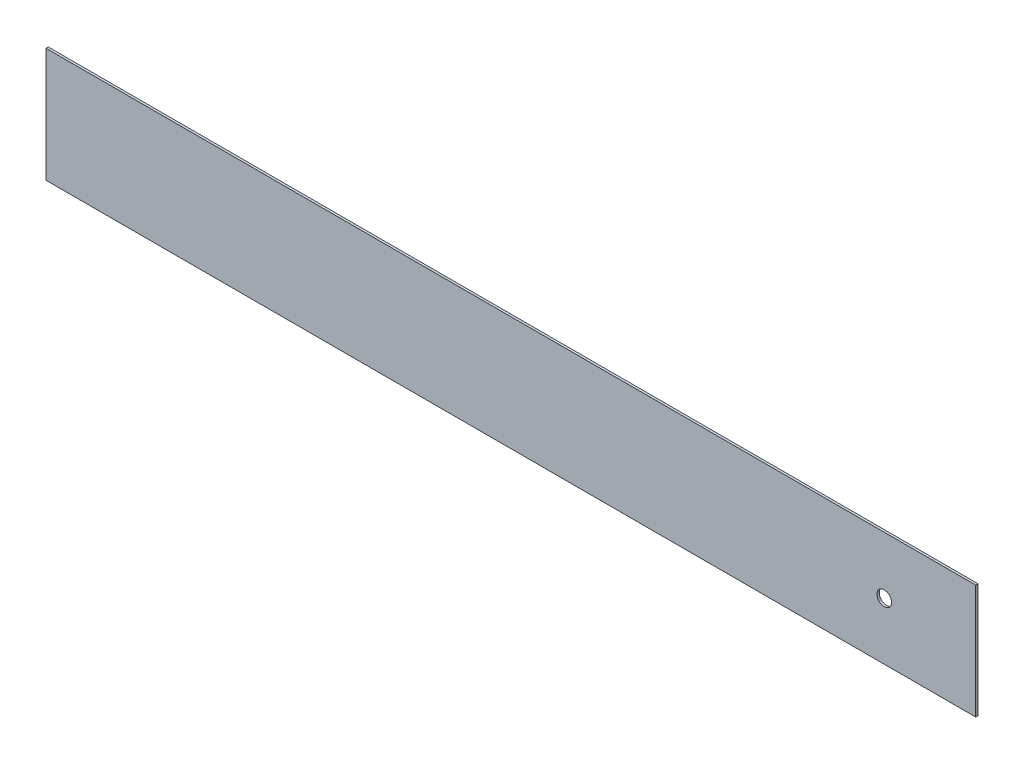
ISO-10303-21;
HEADER;
FILE_DESCRIPTION(('STEP AP214'),'2;1');
FILE_NAME('part.step','',(''),(''),'','','');
FILE_SCHEMA(('AUTOMOTIVE_DESIGN { 1 0 10303 214 1 1 1 1 }'));
ENDSEC;
DATA;
#1=APPLICATION_CONTEXT('core data for automotive mechanical design processes');
#2=APPLICATION_PROTOCOL_DEFINITION('international standard','automotive_design',2000,#1);
#3=PRODUCT_CONTEXT('',#1,'mechanical');
#4=PRODUCT('Part','Part','',(#3));
#5=PRODUCT_RELATED_PRODUCT_CATEGORY('part','',(#4));
#6=PRODUCT_DEFINITION_FORMATION('','',#4);
#7=PRODUCT_DEFINITION_CONTEXT('part definition',#1,'design');
#8=PRODUCT_DEFINITION('design','',#6,#7);
#9=PRODUCT_DEFINITION_SHAPE('','',#8);
#10=(LENGTH_UNIT() NAMED_UNIT(*) SI_UNIT(.MILLI.,.METRE.));
#11=(NAMED_UNIT(*) PLANE_ANGLE_UNIT() SI_UNIT($,.RADIAN.));
#12=(NAMED_UNIT(*) SI_UNIT($,.STERADIAN.) SOLID_ANGLE_UNIT());
#13=UNCERTAINTY_MEASURE_WITH_UNIT(LENGTH_MEASURE(1.E-05),#10,'distance_accuracy_value','');
#14=(GEOMETRIC_REPRESENTATION_CONTEXT(3) GLOBAL_UNCERTAINTY_ASSIGNED_CONTEXT((#13)) GLOBAL_UNIT_ASSIGNED_CONTEXT((#10,
#11,#12)) REPRESENTATION_CONTEXT('',''));
#15=CARTESIAN_POINT('',(0.,0.,0.));
#16=DIRECTION('',(0.,0.,1.));
#17=DIRECTION('',(1.,0.,0.));
#18=AXIS2_PLACEMENT_3D('',#15,#16,#17);
#19=CARTESIAN_POINT('',(0.,0.,3.));
#20=DIRECTION('',(0.,0.,1.));
#21=DIRECTION('',(1.,0.,0.));
#22=AXIS2_PLACEMENT_3D('',#19,#20,#21);
#23=PLANE('',#22);
#24=DIRECTION('',(0.,1.,0.));
#25=VECTOR('',#24,1.);
#26=CARTESIAN_POINT('',(610.,75.,3.));
#27=LINE('',#26,#25);
#28=CARTESIAN_POINT('',(610.,-75.,3.));
#29=VERTEX_POINT('',#28);
#30=CARTESIAN_POINT('',(610.,75.,3.));
#31=VERTEX_POINT('',#30);
#32=EDGE_CURVE('E87',#29,#31,#27,.T.);
#33=ORIENTED_EDGE('',*,*,#32,.T.);
#34=DIRECTION('',(-1.,0.,0.));
#35=VECTOR('',#34,1.);
#36=CARTESIAN_POINT('',(-610.,75.,3.));
#37=LINE('',#36,#35);
#38=CARTESIAN_POINT('',(-610.,75.,3.));
#39=VERTEX_POINT('',#38);
#40=EDGE_CURVE('E82',#31,#39,#37,.T.);
#41=ORIENTED_EDGE('',*,*,#40,.T.);
#42=DIRECTION('',(0.,-1.,0.));
#43=VECTOR('',#42,1.);
#44=CARTESIAN_POINT('',(-610.,75.,3.));
#45=LINE('',#44,#43);
#46=CARTESIAN_POINT('',(-610.,-75.,3.));
#47=VERTEX_POINT('',#46);
#48=EDGE_CURVE('E85',#39,#47,#45,.T.);
#49=ORIENTED_EDGE('',*,*,#48,.T.);
#50=DIRECTION('',(1.,0.,0.));
#51=VECTOR('',#50,1.);
#52=CARTESIAN_POINT('',(-610.,-75.,3.));
#53=LINE('',#52,#51);
#54=EDGE_CURVE('E52',#47,#29,#53,.T.);
#55=ORIENTED_EDGE('',*,*,#54,.T.);
#56=EDGE_LOOP('',(#33,#41,#49,#55));
#57=FACE_BOUND('',#56,.T.);
#58=CARTESIAN_POINT('',(490.,0.,3.));
#59=DIRECTION('',(0.,0.,1.));
#60=DIRECTION('',(1.,0.,0.));
#61=AXIS2_PLACEMENT_3D('',#58,#59,#60);
#62=CIRCLE('',#61,9.6);
#63=CARTESIAN_POINT('',(499.6,0.,3.));
#64=VERTEX_POINT('',#63);
#65=EDGE_CURVE('E102',#64,#64,#62,.T.);
#66=ORIENTED_EDGE('',*,*,#65,.F.);
#67=EDGE_LOOP('',(#66));
#68=FACE_BOUND('',#67,.T.);
#69=ADVANCED_FACE('F35',(#57,#68),#23,.T.);
#70=CARTESIAN_POINT('',(0.,0.,0.));
#71=DIRECTION('',(0.,0.,1.));
#72=DIRECTION('',(1.,0.,0.));
#73=AXIS2_PLACEMENT_3D('',#70,#71,#72);
#74=PLANE('',#73);
#75=DIRECTION('',(0.,1.,0.));
#76=VECTOR('',#75,1.);
#77=CARTESIAN_POINT('',(610.,75.,0.));
#78=LINE('',#77,#76);
#79=CARTESIAN_POINT('',(610.,-75.,0.));
#80=VERTEX_POINT('',#79);
#81=CARTESIAN_POINT('',(610.,75.,0.));
#82=VERTEX_POINT('',#81);
#83=EDGE_CURVE('E99',#80,#82,#78,.T.);
#84=ORIENTED_EDGE('',*,*,#83,.F.);
#85=DIRECTION('',(1.,0.,0.));
#86=VECTOR('',#85,1.);
#87=CARTESIAN_POINT('',(-610.,-75.,0.));
#88=LINE('',#87,#86);
#89=CARTESIAN_POINT('',(-610.,-75.,0.));
#90=VERTEX_POINT('',#89);
#91=EDGE_CURVE('E75',#90,#80,#88,.T.);
#92=ORIENTED_EDGE('',*,*,#91,.F.);
#93=DIRECTION('',(0.,-1.,0.));
#94=VECTOR('',#93,1.);
#95=CARTESIAN_POINT('',(-610.,75.,0.));
#96=LINE('',#95,#94);
#97=CARTESIAN_POINT('',(-610.,75.,0.));
#98=VERTEX_POINT('',#97);
#99=EDGE_CURVE('E69',#98,#90,#96,.T.);
#100=ORIENTED_EDGE('',*,*,#99,.F.);
#101=DIRECTION('',(-1.,0.,0.));
#102=VECTOR('',#101,1.);
#103=CARTESIAN_POINT('',(-610.,75.,0.));
#104=LINE('',#103,#102);
#105=EDGE_CURVE('E91',#82,#98,#104,.T.);
#106=ORIENTED_EDGE('',*,*,#105,.F.);
#107=EDGE_LOOP('',(#84,#92,#100,#106));
#108=FACE_BOUND('',#107,.T.);
#109=CARTESIAN_POINT('',(490.,0.,0.));
#110=DIRECTION('',(0.,0.,1.));
#111=DIRECTION('',(1.,0.,0.));
#112=AXIS2_PLACEMENT_3D('',#109,#110,#111);
#113=CIRCLE('',#112,9.6);
#114=CARTESIAN_POINT('',(499.6,0.,0.));
#115=VERTEX_POINT('',#114);
#116=EDGE_CURVE('E114',#115,#115,#113,.T.);
#117=ORIENTED_EDGE('',*,*,#116,.T.);
#118=EDGE_LOOP('',(#117));
#119=FACE_BOUND('',#118,.T.);
#120=ADVANCED_FACE('F110',(#108,#119),#74,.F.);
#121=CARTESIAN_POINT('',(610.,75.,3.));
#122=DIRECTION('',(-1.,0.,0.));
#123=DIRECTION('',(0.,-1.,0.));
#124=AXIS2_PLACEMENT_3D('',#121,#122,#123);
#125=PLANE('',#124);
#126=ORIENTED_EDGE('',*,*,#83,.T.);
#127=DIRECTION('',(0.,0.,-1.));
#128=VECTOR('',#127,1.);
#129=CARTESIAN_POINT('',(610.,75.,3.));
#130=LINE('',#129,#128);
#131=EDGE_CURVE('E11',#31,#82,#130,.T.);
#132=ORIENTED_EDGE('',*,*,#131,.F.);
#133=ORIENTED_EDGE('',*,*,#32,.F.);
#134=DIRECTION('',(0.,0.,-1.));
#135=VECTOR('',#134,1.);
#136=CARTESIAN_POINT('',(610.,-75.,3.));
#137=LINE('',#136,#135);
#138=EDGE_CURVE('E95',#29,#80,#137,.T.);
#139=ORIENTED_EDGE('',*,*,#138,.T.);
#140=EDGE_LOOP('',(#126,#132,#133,#139));
#141=FACE_BOUND('',#140,.T.);
#142=ADVANCED_FACE('F37',(#141),#125,.F.);
#143=CARTESIAN_POINT('',(-610.,75.,3.));
#144=DIRECTION('',(0.,-1.,0.));
#145=DIRECTION('',(0.,0.,-1.));
#146=AXIS2_PLACEMENT_3D('',#143,#144,#145);
#147=PLANE('',#146);
#148=ORIENTED_EDGE('',*,*,#105,.T.);
#149=DIRECTION('',(0.,0.,-1.));
#150=VECTOR('',#149,1.);
#151=CARTESIAN_POINT('',(-610.,75.,3.));
#152=LINE('',#151,#150);
#153=EDGE_CURVE('E44',#39,#98,#152,.T.);
#154=ORIENTED_EDGE('',*,*,#153,.F.);
#155=ORIENTED_EDGE('',*,*,#40,.F.);
#156=ORIENTED_EDGE('',*,*,#131,.T.);
#157=EDGE_LOOP('',(#148,#154,#155,#156));
#158=FACE_BOUND('',#157,.T.);
#159=ADVANCED_FACE('F90',(#158),#147,.F.);
#160=CARTESIAN_POINT('',(-610.,75.,3.));
#161=DIRECTION('',(1.,0.,0.));
#162=DIRECTION('',(0.,1.,0.));
#163=AXIS2_PLACEMENT_3D('',#160,#161,#162);
#164=PLANE('',#163);
#165=ORIENTED_EDGE('',*,*,#99,.T.);
#166=DIRECTION('',(0.,0.,-1.));
#167=VECTOR('',#166,1.);
#168=CARTESIAN_POINT('',(-610.,-75.,3.));
#169=LINE('',#168,#167);
#170=EDGE_CURVE('E92',#47,#90,#169,.T.);
#171=ORIENTED_EDGE('',*,*,#170,.F.);
#172=ORIENTED_EDGE('',*,*,#48,.F.);
#173=ORIENTED_EDGE('',*,*,#153,.T.);
#174=EDGE_LOOP('',(#165,#171,#172,#173));
#175=FACE_BOUND('',#174,.T.);
#176=ADVANCED_FACE('F93',(#175),#164,.F.);
#177=CARTESIAN_POINT('',(-610.,-75.,3.));
#178=DIRECTION('',(0.,1.,0.));
#179=DIRECTION('',(0.,0.,1.));
#180=AXIS2_PLACEMENT_3D('',#177,#178,#179);
#181=PLANE('',#180);
#182=ORIENTED_EDGE('',*,*,#91,.T.);
#183=ORIENTED_EDGE('',*,*,#138,.F.);
#184=ORIENTED_EDGE('',*,*,#54,.F.);
#185=ORIENTED_EDGE('',*,*,#170,.T.);
#186=EDGE_LOOP('',(#182,#183,#184,#185));
#187=FACE_BOUND('',#186,.T.);
#188=ADVANCED_FACE('F107',(#187),#181,.F.);
#189=CARTESIAN_POINT('',(490.,0.,3.));
#190=DIRECTION('',(0.,0.,-1.));
#191=DIRECTION('',(-1.,0.,0.));
#192=AXIS2_PLACEMENT_3D('',#189,#190,#191);
#193=CYLINDRICAL_SURFACE('',#192,9.6);
#194=ORIENTED_EDGE('',*,*,#65,.T.);
#195=EDGE_LOOP('',(#194));
#196=FACE_BOUND('',#195,.T.);
#197=ORIENTED_EDGE('',*,*,#116,.F.);
#198=EDGE_LOOP('',(#197));
#199=FACE_BOUND('',#198,.T.);
#200=ADVANCED_FACE('F120',(#196,#199),#193,.F.);
#201=CLOSED_SHELL('',(#69,#120,#142,#159,#176,#188,#200));
#202=MANIFOLD_SOLID_BREP('B2',#201);
#203=ADVANCED_BREP_SHAPE_REPRESENTATION('',(#18,#202),#14);
#204=SHAPE_DEFINITION_REPRESENTATION(#9,#203);
ENDSEC;
END-ISO-10303-21;
